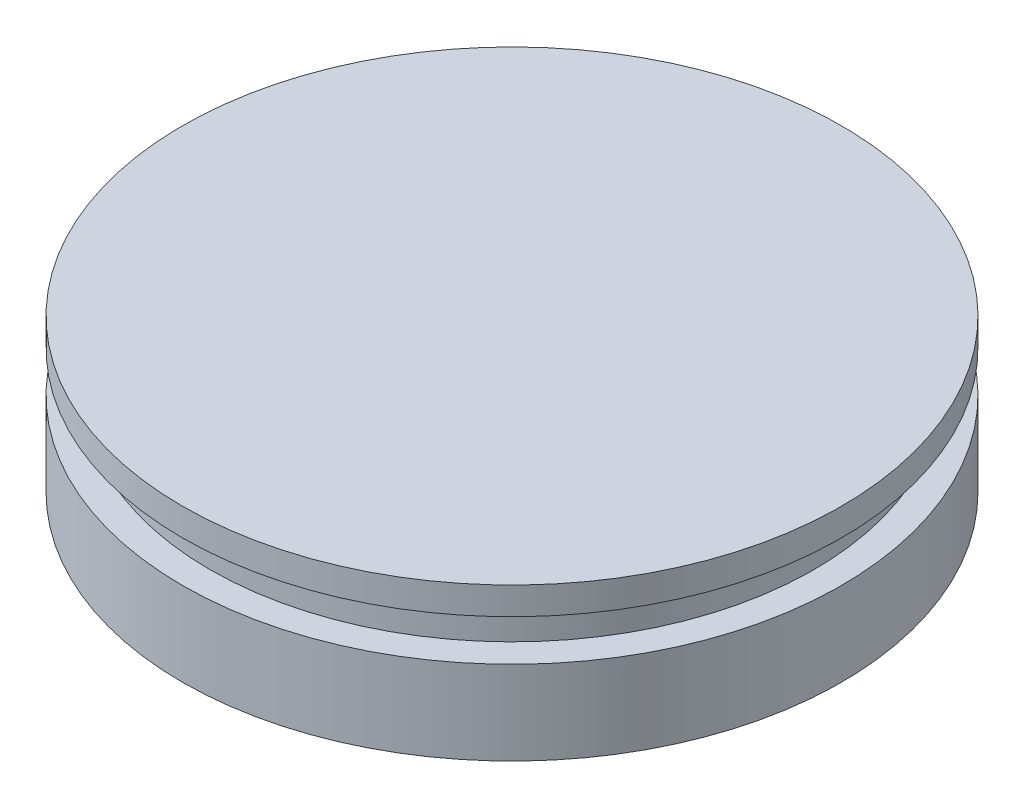
ISO-10303-21;
HEADER;
FILE_DESCRIPTION(('STEP AP214'),'2;1');
FILE_NAME('part.step','',(''),(''),'','','');
FILE_SCHEMA(('AUTOMOTIVE_DESIGN { 1 0 10303 214 1 1 1 1 }'));
ENDSEC;
DATA;
#1=APPLICATION_CONTEXT('core data for automotive mechanical design processes');
#2=APPLICATION_PROTOCOL_DEFINITION('international standard','automotive_design',2000,#1);
#3=PRODUCT_CONTEXT('',#1,'mechanical');
#4=PRODUCT('Part','Part','',(#3));
#5=PRODUCT_RELATED_PRODUCT_CATEGORY('part','',(#4));
#6=PRODUCT_DEFINITION_FORMATION('','',#4);
#7=PRODUCT_DEFINITION_CONTEXT('part definition',#1,'design');
#8=PRODUCT_DEFINITION('design','',#6,#7);
#9=PRODUCT_DEFINITION_SHAPE('','',#8);
#10=(LENGTH_UNIT() NAMED_UNIT(*) SI_UNIT(.MILLI.,.METRE.));
#11=(NAMED_UNIT(*) PLANE_ANGLE_UNIT() SI_UNIT($,.RADIAN.));
#12=(NAMED_UNIT(*) SI_UNIT($,.STERADIAN.) SOLID_ANGLE_UNIT());
#13=UNCERTAINTY_MEASURE_WITH_UNIT(LENGTH_MEASURE(1.E-05),#10,'distance_accuracy_value','');
#14=(GEOMETRIC_REPRESENTATION_CONTEXT(3) GLOBAL_UNCERTAINTY_ASSIGNED_CONTEXT((#13)) GLOBAL_UNIT_ASSIGNED_CONTEXT((#10,
#11,#12)) REPRESENTATION_CONTEXT('',''));
#15=CARTESIAN_POINT('',(0.,0.,0.));
#16=DIRECTION('',(0.,0.,1.));
#17=DIRECTION('',(1.,0.,0.));
#18=AXIS2_PLACEMENT_3D('',#15,#16,#17);
#19=CARTESIAN_POINT('',(-2.08166817117217E-13,1729.74,0.));
#20=DIRECTION('',(0.,1.,0.));
#21=DIRECTION('',(-1.,0.,0.));
#22=AXIS2_PLACEMENT_3D('',#19,#20,#21);
#23=SPHERICAL_SURFACE('',#22,139.954);
#24=CARTESIAN_POINT('',(0.,1847.13115007529,0.));
#25=DIRECTION('',(0.,1.,0.));
#26=DIRECTION('',(0.,0.,1.));
#27=AXIS2_PLACEMENT_3D('',#24,#25,#26);
#28=CIRCLE('',#27,76.2000000000002);
#29=CARTESIAN_POINT('',(0.,1847.13115007529,76.2000000000002));
#30=VERTEX_POINT('',#29);
#31=EDGE_CURVE('E10',#30,#30,#28,.T.);
#32=ORIENTED_EDGE('',*,*,#31,.F.);
#33=EDGE_LOOP('',(#32));
#34=FACE_BOUND('',#33,.T.);
#35=ADVANCED_FACE('F39',(#34),#23,.F.);
#36=CARTESIAN_POINT('',(0.,50.3580155806544,0.));
#37=DIRECTION('',(0.,1.,0.));
#38=DIRECTION('',(0.,0.,1.));
#39=AXIS2_PLACEMENT_3D('',#36,#37,#38);
#40=CYLINDRICAL_SURFACE('',#39,76.2000000000002);
#41=ORIENTED_EDGE('',*,*,#31,.T.);
#42=EDGE_LOOP('',(#41));
#43=FACE_BOUND('',#42,.T.);
#44=CARTESIAN_POINT('',(0.,1866.519,0.));
#45=DIRECTION('',(0.,1.,0.));
#46=DIRECTION('',(0.,0.,1.));
#47=AXIS2_PLACEMENT_3D('',#44,#45,#46);
#48=CIRCLE('',#47,76.2000000000002);
#49=CARTESIAN_POINT('',(0.,1866.519,76.2000000000002));
#50=VERTEX_POINT('',#49);
#51=EDGE_CURVE('E46',#50,#50,#48,.T.);
#52=ORIENTED_EDGE('',*,*,#51,.F.);
#53=EDGE_LOOP('',(#52));
#54=FACE_BOUND('',#53,.T.);
#55=ADVANCED_FACE('F87',(#43,#54),#40,.T.);
#56=CARTESIAN_POINT('',(-69.8500000000002,1866.519,0.));
#57=DIRECTION('',(0.,1.,0.));
#58=DIRECTION('',(0.,0.,1.));
#59=AXIS2_PLACEMENT_3D('',#56,#57,#58);
#60=PLANE('',#59);
#61=ORIENTED_EDGE('',*,*,#51,.T.);
#62=EDGE_LOOP('',(#61));
#63=FACE_BOUND('',#62,.T.);
#64=CARTESIAN_POINT('',(0.,1866.519,0.));
#65=DIRECTION('',(0.,1.,0.));
#66=DIRECTION('',(0.,0.,1.));
#67=AXIS2_PLACEMENT_3D('',#64,#65,#66);
#68=CIRCLE('',#67,69.8500000000002);
#69=CARTESIAN_POINT('',(0.,1866.519,69.8500000000002));
#70=VERTEX_POINT('',#69);
#71=EDGE_CURVE('E51',#70,#70,#68,.T.);
#72=ORIENTED_EDGE('',*,*,#71,.F.);
#73=EDGE_LOOP('',(#72));
#74=FACE_BOUND('',#73,.T.);
#75=ADVANCED_FACE('F92',(#63,#74),#60,.T.);
#76=CARTESIAN_POINT('',(0.,50.3580155806544,0.));
#77=DIRECTION('',(0.,1.,0.));
#78=DIRECTION('',(0.,0.,1.));
#79=AXIS2_PLACEMENT_3D('',#76,#77,#78);
#80=CYLINDRICAL_SURFACE('',#79,69.8500000000002);
#81=ORIENTED_EDGE('',*,*,#71,.T.);
#82=EDGE_LOOP('',(#81));
#83=FACE_BOUND('',#82,.T.);
#84=CARTESIAN_POINT('',(0.,1876.044,0.));
#85=DIRECTION('',(0.,1.,0.));
#86=DIRECTION('',(0.,0.,1.));
#87=AXIS2_PLACEMENT_3D('',#84,#85,#86);
#88=CIRCLE('',#87,69.8500000000002);
#89=CARTESIAN_POINT('',(0.,1876.044,69.8500000000002));
#90=VERTEX_POINT('',#89);
#91=EDGE_CURVE('E56',#90,#90,#88,.T.);
#92=ORIENTED_EDGE('',*,*,#91,.F.);
#93=EDGE_LOOP('',(#92));
#94=FACE_BOUND('',#93,.T.);
#95=ADVANCED_FACE('F83',(#83,#94),#80,.T.);
#96=CARTESIAN_POINT('',(-69.8500000000002,1876.044,0.));
#97=DIRECTION('',(0.,-1.,0.));
#98=DIRECTION('',(0.,0.,-1.));
#99=AXIS2_PLACEMENT_3D('',#96,#97,#98);
#100=PLANE('',#99);
#101=ORIENTED_EDGE('',*,*,#91,.T.);
#102=EDGE_LOOP('',(#101));
#103=FACE_BOUND('',#102,.T.);
#104=CARTESIAN_POINT('',(0.,1876.044,0.));
#105=DIRECTION('',(0.,1.,0.));
#106=DIRECTION('',(0.,0.,1.));
#107=AXIS2_PLACEMENT_3D('',#104,#105,#106);
#108=CIRCLE('',#107,76.2000000000002);
#109=CARTESIAN_POINT('',(0.,1876.044,76.2000000000002));
#110=VERTEX_POINT('',#109);
#111=EDGE_CURVE('E62',#110,#110,#108,.T.);
#112=ORIENTED_EDGE('',*,*,#111,.F.);
#113=EDGE_LOOP('',(#112));
#114=FACE_BOUND('',#113,.T.);
#115=ADVANCED_FACE('F75',(#103,#114),#100,.T.);
#116=CARTESIAN_POINT('',(0.,50.3580155806544,0.));
#117=DIRECTION('',(0.,1.,0.));
#118=DIRECTION('',(0.,0.,1.));
#119=AXIS2_PLACEMENT_3D('',#116,#117,#118);
#120=CYLINDRICAL_SURFACE('',#119,76.2000000000002);
#121=ORIENTED_EDGE('',*,*,#111,.T.);
#122=EDGE_LOOP('',(#121));
#123=FACE_BOUND('',#122,.T.);
#124=CARTESIAN_POINT('',(0.,1882.394,0.));
#125=DIRECTION('',(0.,1.,0.));
#126=DIRECTION('',(0.,0.,1.));
#127=AXIS2_PLACEMENT_3D('',#124,#125,#126);
#128=CIRCLE('',#127,76.2000000000002);
#129=CARTESIAN_POINT('',(0.,1882.394,76.2000000000002));
#130=VERTEX_POINT('',#129);
#131=EDGE_CURVE('E66',#130,#130,#128,.T.);
#132=ORIENTED_EDGE('',*,*,#131,.F.);
#133=EDGE_LOOP('',(#132));
#134=FACE_BOUND('',#133,.T.);
#135=ADVANCED_FACE('F73',(#123,#134),#120,.T.);
#136=CARTESIAN_POINT('',(-76.2000000000002,1882.394,0.));
#137=DIRECTION('',(0.,1.,0.));
#138=DIRECTION('',(0.,0.,1.));
#139=AXIS2_PLACEMENT_3D('',#136,#137,#138);
#140=PLANE('',#139);
#141=ORIENTED_EDGE('',*,*,#131,.T.);
#142=EDGE_LOOP('',(#141));
#143=FACE_BOUND('',#142,.T.);
#144=ADVANCED_FACE('F71',(#143),#140,.T.);
#145=CLOSED_SHELL('',(#35,#55,#75,#95,#115,#135,#144));
#146=MANIFOLD_SOLID_BREP('B2',#145);
#147=ADVANCED_BREP_SHAPE_REPRESENTATION('',(#18,#146),#14);
#148=SHAPE_DEFINITION_REPRESENTATION(#9,#147);
ENDSEC;
END-ISO-10303-21;
